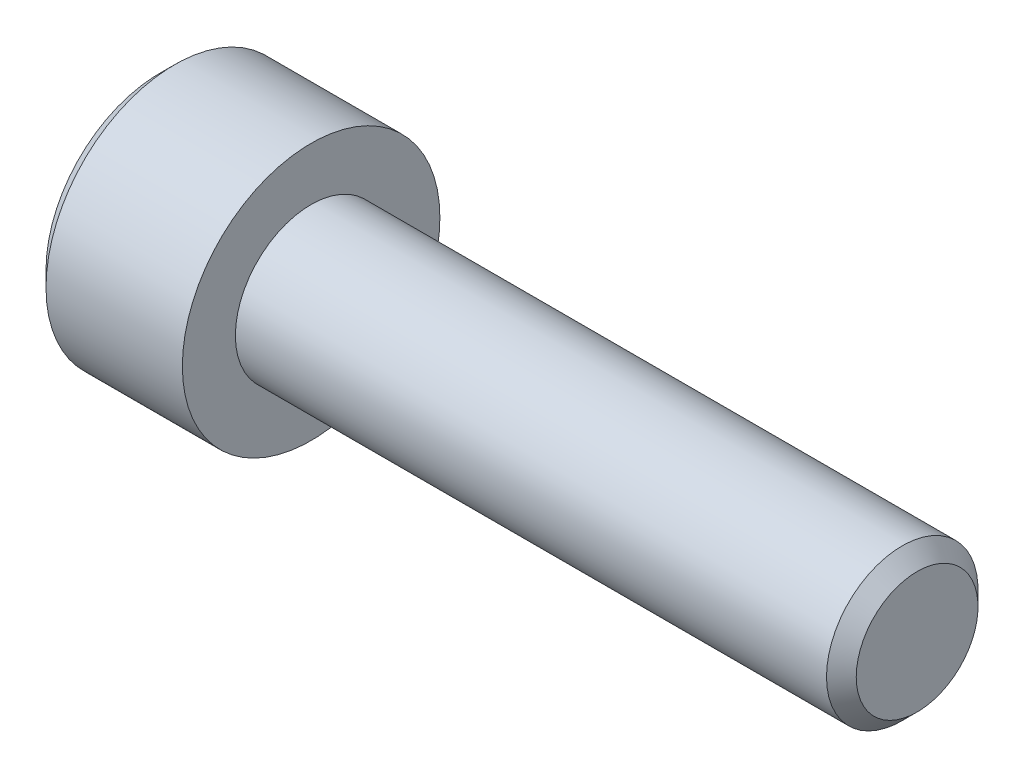
ISO-10303-21;
HEADER;
FILE_DESCRIPTION(('STEP AP214'),'2;1');
FILE_NAME('part.step','',(''),(''),'','','');
FILE_SCHEMA(('AUTOMOTIVE_DESIGN { 1 0 10303 214 1 1 1 1 }'));
ENDSEC;
DATA;
#1=APPLICATION_CONTEXT('core data for automotive mechanical design processes');
#2=APPLICATION_PROTOCOL_DEFINITION('international standard','automotive_design',2000,#1);
#3=PRODUCT_CONTEXT('',#1,'mechanical');
#4=PRODUCT('Part','Part','',(#3));
#5=PRODUCT_RELATED_PRODUCT_CATEGORY('part','',(#4));
#6=PRODUCT_DEFINITION_FORMATION('','',#4);
#7=PRODUCT_DEFINITION_CONTEXT('part definition',#1,'design');
#8=PRODUCT_DEFINITION('design','',#6,#7);
#9=PRODUCT_DEFINITION_SHAPE('','',#8);
#10=(LENGTH_UNIT() NAMED_UNIT(*) SI_UNIT(.MILLI.,.METRE.));
#11=(NAMED_UNIT(*) PLANE_ANGLE_UNIT() SI_UNIT($,.RADIAN.));
#12=(NAMED_UNIT(*) SI_UNIT($,.STERADIAN.) SOLID_ANGLE_UNIT());
#13=UNCERTAINTY_MEASURE_WITH_UNIT(LENGTH_MEASURE(1.E-05),#10,'distance_accuracy_value','');
#14=(GEOMETRIC_REPRESENTATION_CONTEXT(3) GLOBAL_UNCERTAINTY_ASSIGNED_CONTEXT((#13)) GLOBAL_UNIT_ASSIGNED_CONTEXT((#10,
#11,#12)) REPRESENTATION_CONTEXT('',''));
#15=CARTESIAN_POINT('',(0.,0.,0.));
#16=DIRECTION('',(0.,0.,1.));
#17=DIRECTION('',(1.,0.,0.));
#18=AXIS2_PLACEMENT_3D('',#15,#16,#17);
#19=CARTESIAN_POINT('',(-2.5,0.,0.));
#20=DIRECTION('',(1.,0.,0.));
#21=DIRECTION('',(0.,0.,-1.));
#22=AXIS2_PLACEMENT_3D('',#19,#20,#21);
#23=PLANE('',#22);
#24=DIRECTION('',(0.,1.,0.));
#25=VECTOR('',#24,1.);
#26=CARTESIAN_POINT('',(-2.5,0.,2.));
#27=LINE('',#26,#25);
#28=CARTESIAN_POINT('',(-2.5,1.15470053837925,2.));
#29=VERTEX_POINT('',#28);
#30=CARTESIAN_POINT('',(-2.49999999999988,0.,2.00000000000477));
#31=VERTEX_POINT('',#30);
#32=EDGE_CURVE('E109',#29,#31,#27,.F.);
#33=ORIENTED_EDGE('',*,*,#32,.F.);
#34=DIRECTION('',(0.,-0.500000000000003,0.866025403784437));
#35=VECTOR('',#34,1.);
#36=CARTESIAN_POINT('',(-2.5,1.73205080756888,1.));
#37=LINE('',#36,#35);
#38=CARTESIAN_POINT('',(-2.49999999999988,1.73205080757301,1.00000000000239));
#39=VERTEX_POINT('',#38);
#40=EDGE_CURVE('E93',#39,#29,#37,.T.);
#41=ORIENTED_EDGE('',*,*,#40,.F.);
#42=CARTESIAN_POINT('',(-2.49999999999977,0.,0.));
#43=DIRECTION('',(-1.,0.,0.));
#44=DIRECTION('',(0.,0.,1.));
#45=AXIS2_PLACEMENT_3D('',#42,#43,#44);
#46=CIRCLE('',#45,2.00000000000955);
#47=EDGE_CURVE('E20',#39,#31,#46,.F.);
#48=ORIENTED_EDGE('',*,*,#47,.T.);
#49=EDGE_LOOP('',(#33,#41,#48));
#50=FACE_BOUND('',#49,.T.);
#51=ADVANCED_FACE('F17',(#50),#23,.F.);
#52=CARTESIAN_POINT('',(-2.5,0.,0.));
#53=DIRECTION('',(1.,0.,0.));
#54=DIRECTION('',(0.,0.,-1.));
#55=AXIS2_PLACEMENT_3D('',#52,#53,#54);
#56=PLANE('',#55);
#57=DIRECTION('',(0.,0.499999999999996,-0.866025403784441));
#58=VECTOR('',#57,1.);
#59=CARTESIAN_POINT('',(-2.5,-2.3094010767585,0.));
#60=LINE('',#59,#58);
#61=CARTESIAN_POINT('',(-2.5,-2.3094010767585,0.));
#62=VERTEX_POINT('',#61);
#63=CARTESIAN_POINT('',(-2.49999999999988,-1.73205080757301,-1.00000000000239));
#64=VERTEX_POINT('',#63);
#65=EDGE_CURVE('E149',#62,#64,#60,.T.);
#66=ORIENTED_EDGE('',*,*,#65,.F.);
#67=DIRECTION('',(0.,-0.499999999999996,-0.866025403784441));
#68=VECTOR('',#67,1.);
#69=CARTESIAN_POINT('',(-2.5,-1.73205080756888,1.));
#70=LINE('',#69,#68);
#71=CARTESIAN_POINT('',(-2.49999999999977,-1.73205080757301,1.00000000000239));
#72=VERTEX_POINT('',#71);
#73=EDGE_CURVE('E153',#72,#62,#70,.T.);
#74=ORIENTED_EDGE('',*,*,#73,.F.);
#75=CARTESIAN_POINT('',(-2.49999999999977,0.,0.));
#76=DIRECTION('',(-1.,0.,0.));
#77=DIRECTION('',(0.,0.,1.));
#78=AXIS2_PLACEMENT_3D('',#75,#76,#77);
#79=CIRCLE('',#78,2.00000000000955);
#80=EDGE_CURVE('E123',#72,#64,#79,.F.);
#81=ORIENTED_EDGE('',*,*,#80,.T.);
#82=EDGE_LOOP('',(#66,#74,#81));
#83=FACE_BOUND('',#82,.T.);
#84=ADVANCED_FACE('F420',(#83),#56,.F.);
#85=CARTESIAN_POINT('',(-2.5,0.,0.));
#86=DIRECTION('',(1.,0.,0.));
#87=DIRECTION('',(0.,0.,-1.));
#88=AXIS2_PLACEMENT_3D('',#85,#86,#87);
#89=PLANE('',#88);
#90=DIRECTION('',(0.,1.,0.));
#91=VECTOR('',#90,1.);
#92=CARTESIAN_POINT('',(-2.5,0.,-2.));
#93=LINE('',#92,#91);
#94=CARTESIAN_POINT('',(-2.5,-1.15470053837925,-2.));
#95=VERTEX_POINT('',#94);
#96=CARTESIAN_POINT('',(-2.49999999999988,0.,-2.00000000000477));
#97=VERTEX_POINT('',#96);
#98=EDGE_CURVE('E141',#95,#97,#93,.T.);
#99=ORIENTED_EDGE('',*,*,#98,.F.);
#100=DIRECTION('',(0.,0.500000000000003,-0.866025403784437));
#101=VECTOR('',#100,1.);
#102=CARTESIAN_POINT('',(-2.5,-1.73205080756888,-1.));
#103=LINE('',#102,#101);
#104=EDGE_CURVE('E145',#64,#95,#103,.T.);
#105=ORIENTED_EDGE('',*,*,#104,.F.);
#106=CARTESIAN_POINT('',(-2.49999999999977,0.,0.));
#107=DIRECTION('',(-1.,0.,0.));
#108=DIRECTION('',(0.,0.,1.));
#109=AXIS2_PLACEMENT_3D('',#106,#107,#108);
#110=CIRCLE('',#109,2.00000000000955);
#111=EDGE_CURVE('E125',#64,#97,#110,.F.);
#112=ORIENTED_EDGE('',*,*,#111,.T.);
#113=EDGE_LOOP('',(#99,#105,#112));
#114=FACE_BOUND('',#113,.T.);
#115=ADVANCED_FACE('F207',(#114),#89,.F.);
#116=CARTESIAN_POINT('',(-2.5,0.,0.));
#117=DIRECTION('',(1.,0.,0.));
#118=DIRECTION('',(0.,0.,-1.));
#119=AXIS2_PLACEMENT_3D('',#116,#117,#118);
#120=PLANE('',#119);
#121=DIRECTION('',(0.,0.500000000000003,0.866025403784437));
#122=VECTOR('',#121,1.);
#123=CARTESIAN_POINT('',(-2.5,1.15470053837925,-2.));
#124=LINE('',#123,#122);
#125=CARTESIAN_POINT('',(-2.5,1.15470053837925,-2.));
#126=VERTEX_POINT('',#125);
#127=CARTESIAN_POINT('',(-2.49999999999988,1.73205080757301,-1.00000000000239));
#128=VERTEX_POINT('',#127);
#129=EDGE_CURVE('E101',#126,#128,#124,.T.);
#130=ORIENTED_EDGE('',*,*,#129,.F.);
#131=DIRECTION('',(0.,1.,0.));
#132=VECTOR('',#131,1.);
#133=CARTESIAN_POINT('',(-2.5,0.,-2.));
#134=LINE('',#133,#132);
#135=EDGE_CURVE('E137',#97,#126,#134,.T.);
#136=ORIENTED_EDGE('',*,*,#135,.F.);
#137=CARTESIAN_POINT('',(-2.49999999999977,0.,0.));
#138=DIRECTION('',(-1.,0.,0.));
#139=DIRECTION('',(0.,0.,1.));
#140=AXIS2_PLACEMENT_3D('',#137,#138,#139);
#141=CIRCLE('',#140,2.00000000000955);
#142=EDGE_CURVE('E117',#97,#128,#141,.F.);
#143=ORIENTED_EDGE('',*,*,#142,.T.);
#144=EDGE_LOOP('',(#130,#136,#143));
#145=FACE_BOUND('',#144,.T.);
#146=ADVANCED_FACE('F210',(#145),#120,.F.);
#147=CARTESIAN_POINT('',(-2.5,0.,0.));
#148=DIRECTION('',(1.,0.,0.));
#149=DIRECTION('',(0.,0.,-1.));
#150=AXIS2_PLACEMENT_3D('',#147,#148,#149);
#151=PLANE('',#150);
#152=CARTESIAN_POINT('',(-2.49999999999977,0.,0.));
#153=DIRECTION('',(-1.,0.,0.));
#154=DIRECTION('',(0.,0.,1.));
#155=AXIS2_PLACEMENT_3D('',#152,#153,#154);
#156=CIRCLE('',#155,2.00000000000955);
#157=EDGE_CURVE('E112',#128,#39,#156,.F.);
#158=ORIENTED_EDGE('',*,*,#157,.T.);
#159=DIRECTION('',(0.,-0.499999999999996,0.866025403784441));
#160=VECTOR('',#159,1.);
#161=CARTESIAN_POINT('',(-2.5,2.3094010767585,0.));
#162=LINE('',#161,#160);
#163=CARTESIAN_POINT('',(-2.5,2.3094010767585,0.));
#164=VERTEX_POINT('',#163);
#165=EDGE_CURVE('E89',#164,#39,#162,.T.);
#166=ORIENTED_EDGE('',*,*,#165,.F.);
#167=DIRECTION('',(0.,0.499999999999996,0.866025403784441));
#168=VECTOR('',#167,1.);
#169=CARTESIAN_POINT('',(-2.5,1.73205080756888,-1.));
#170=LINE('',#169,#168);
#171=EDGE_CURVE('E100',#128,#164,#170,.T.);
#172=ORIENTED_EDGE('',*,*,#171,.F.);
#173=EDGE_LOOP('',(#158,#166,#172));
#174=FACE_BOUND('',#173,.T.);
#175=ADVANCED_FACE('F113',(#174),#151,.F.);
#176=CARTESIAN_POINT('',(-2.4999999999693,0.,0.));
#177=DIRECTION('',(-1.,0.,0.));
#178=DIRECTION('',(0.,0.,1.));
#179=AXIS2_PLACEMENT_3D('',#176,#177,#178);
#180=CONICAL_SURFACE('',#179,1.99999999989586,1.30899693895162);
#181=CARTESIAN_POINT('',(-1.96410161512972,0.,-1.13686837721616E-10));
#182=VERTEX_POINT('',#181);
#183=VERTEX_LOOP('',#182);
#184=FACE_BOUND('',#183,.T.);
#185=ORIENTED_EDGE('',*,*,#142,.F.);
#186=ORIENTED_EDGE('',*,*,#111,.F.);
#187=ORIENTED_EDGE('',*,*,#80,.F.);
#188=CARTESIAN_POINT('',(-2.49999999999977,0.,0.));
#189=DIRECTION('',(-1.,0.,0.));
#190=DIRECTION('',(0.,0.,1.));
#191=AXIS2_PLACEMENT_3D('',#188,#189,#190);
#192=CIRCLE('',#191,2.00000000000955);
#193=EDGE_CURVE('E116',#72,#31,#192,.T.);
#194=ORIENTED_EDGE('',*,*,#193,.T.);
#195=ORIENTED_EDGE('',*,*,#47,.F.);
#196=ORIENTED_EDGE('',*,*,#157,.F.);
#197=EDGE_LOOP('',(#185,#186,#187,#194,#195,#196));
#198=FACE_BOUND('',#197,.T.);
#199=ADVANCED_FACE('F119',(#184,#198),#180,.F.);
#200=CARTESIAN_POINT('',(-2.5,0.,0.));
#201=DIRECTION('',(1.,0.,0.));
#202=DIRECTION('',(0.,0.,-1.));
#203=AXIS2_PLACEMENT_3D('',#200,#201,#202);
#204=PLANE('',#203);
#205=DIRECTION('',(0.,0.5,0.866025403784439));
#206=VECTOR('',#205,1.);
#207=CARTESIAN_POINT('',(-2.5,-1.15470053837925,2.));
#208=LINE('',#207,#206);
#209=CARTESIAN_POINT('',(-2.5,-1.15470053837925,2.));
#210=VERTEX_POINT('',#209);
#211=EDGE_CURVE('E197',#210,#72,#208,.F.);
#212=ORIENTED_EDGE('',*,*,#211,.F.);
#213=DIRECTION('',(0.,1.,0.));
#214=VECTOR('',#213,1.);
#215=CARTESIAN_POINT('',(-2.5,1.15470053837925,2.));
#216=LINE('',#215,#214);
#217=EDGE_CURVE('E227',#31,#210,#216,.F.);
#218=ORIENTED_EDGE('',*,*,#217,.F.);
#219=ORIENTED_EDGE('',*,*,#193,.F.);
#220=EDGE_LOOP('',(#212,#218,#219));
#221=FACE_BOUND('',#220,.T.);
#222=ADVANCED_FACE('F240',(#221),#204,.F.);
#223=CARTESIAN_POINT('',(-2.5,-1.15470053837925,2.));
#224=DIRECTION('',(0.,0.866025403784439,-0.5));
#225=DIRECTION('',(0.,0.5,0.866025403784439));
#226=AXIS2_PLACEMENT_3D('',#223,#224,#225);
#227=PLANE('',#226);
#228=ORIENTED_EDGE('',*,*,#73,.T.);
#229=DIRECTION('',(1.,0.,0.));
#230=VECTOR('',#229,1.);
#231=CARTESIAN_POINT('',(-2.5,-2.3094010767585,0.));
#232=LINE('',#231,#230);
#233=CARTESIAN_POINT('',(-5.,-2.3094010767585,0.));
#234=VERTEX_POINT('',#233);
#235=EDGE_CURVE('E170',#234,#62,#232,.T.);
#236=ORIENTED_EDGE('',*,*,#235,.F.);
#237=DIRECTION('',(0.,0.499999999999999,0.866025403784439));
#238=VECTOR('',#237,1.);
#239=CARTESIAN_POINT('',(-5.,-2.3094010767585,0.));
#240=LINE('',#239,#238);
#241=CARTESIAN_POINT('',(-5.,-1.15470053837925,2.));
#242=VERTEX_POINT('',#241);
#243=EDGE_CURVE('E175',#234,#242,#240,.T.);
#244=ORIENTED_EDGE('',*,*,#243,.T.);
#245=DIRECTION('',(-1.,0.,0.));
#246=VECTOR('',#245,1.);
#247=CARTESIAN_POINT('',(-2.5,-1.15470053837925,2.));
#248=LINE('',#247,#246);
#249=EDGE_CURVE('E183',#210,#242,#248,.T.);
#250=ORIENTED_EDGE('',*,*,#249,.F.);
#251=ORIENTED_EDGE('',*,*,#211,.T.);
#252=EDGE_LOOP('',(#228,#236,#244,#250,#251));
#253=FACE_BOUND('',#252,.T.);
#254=ADVANCED_FACE('F238',(#253),#227,.T.);
#255=CARTESIAN_POINT('',(-2.5,1.15470053837925,2.));
#256=DIRECTION('',(0.,0.,-1.));
#257=DIRECTION('',(-1.,0.,0.));
#258=AXIS2_PLACEMENT_3D('',#255,#256,#257);
#259=PLANE('',#258);
#260=ORIENTED_EDGE('',*,*,#217,.T.);
#261=ORIENTED_EDGE('',*,*,#249,.T.);
#262=DIRECTION('',(0.,1.,0.));
#263=VECTOR('',#262,1.);
#264=CARTESIAN_POINT('',(-5.,0.,2.));
#265=LINE('',#264,#263);
#266=CARTESIAN_POINT('',(-5.,1.15470053837925,2.));
#267=VERTEX_POINT('',#266);
#268=EDGE_CURVE('E221',#242,#267,#265,.T.);
#269=ORIENTED_EDGE('',*,*,#268,.T.);
#270=DIRECTION('',(1.,0.,0.));
#271=VECTOR('',#270,1.);
#272=CARTESIAN_POINT('',(-2.5,1.15470053837925,2.));
#273=LINE('',#272,#271);
#274=EDGE_CURVE('E166',#29,#267,#273,.F.);
#275=ORIENTED_EDGE('',*,*,#274,.F.);
#276=ORIENTED_EDGE('',*,*,#32,.T.);
#277=EDGE_LOOP('',(#260,#261,#269,#275,#276));
#278=FACE_BOUND('',#277,.T.);
#279=ADVANCED_FACE('F242',(#278),#259,.T.);
#280=CARTESIAN_POINT('',(-2.5,2.3094010767585,0.));
#281=DIRECTION('',(0.,-0.866025403784439,-0.5));
#282=DIRECTION('',(0.,0.5,-0.866025403784439));
#283=AXIS2_PLACEMENT_3D('',#280,#281,#282);
#284=PLANE('',#283);
#285=ORIENTED_EDGE('',*,*,#40,.T.);
#286=ORIENTED_EDGE('',*,*,#274,.T.);
#287=DIRECTION('',(0.,0.499999999999999,-0.866025403784439));
#288=VECTOR('',#287,1.);
#289=CARTESIAN_POINT('',(-5.,1.15470053837925,2.));
#290=LINE('',#289,#288);
#291=CARTESIAN_POINT('',(-5.,2.3094010767585,0.));
#292=VERTEX_POINT('',#291);
#293=EDGE_CURVE('E218',#267,#292,#290,.T.);
#294=ORIENTED_EDGE('',*,*,#293,.T.);
#295=DIRECTION('',(1.,0.,0.));
#296=VECTOR('',#295,1.);
#297=CARTESIAN_POINT('',(-2.5,2.3094010767585,0.));
#298=LINE('',#297,#296);
#299=EDGE_CURVE('E96',#164,#292,#298,.F.);
#300=ORIENTED_EDGE('',*,*,#299,.F.);
#301=ORIENTED_EDGE('',*,*,#165,.T.);
#302=EDGE_LOOP('',(#285,#286,#294,#300,#301));
#303=FACE_BOUND('',#302,.T.);
#304=ADVANCED_FACE('F91',(#303),#284,.T.);
#305=CARTESIAN_POINT('',(-2.5,1.15470053837925,-2.));
#306=DIRECTION('',(0.,-0.866025403784439,0.5));
#307=DIRECTION('',(0.,-0.5,-0.866025403784439));
#308=AXIS2_PLACEMENT_3D('',#305,#306,#307);
#309=PLANE('',#308);
#310=ORIENTED_EDGE('',*,*,#171,.T.);
#311=ORIENTED_EDGE('',*,*,#299,.T.);
#312=DIRECTION('',(0.,-0.499999999999999,-0.866025403784439));
#313=VECTOR('',#312,1.);
#314=CARTESIAN_POINT('',(-5.,2.3094010767585,0.));
#315=LINE('',#314,#313);
#316=CARTESIAN_POINT('',(-5.,1.15470053837925,-2.));
#317=VERTEX_POINT('',#316);
#318=EDGE_CURVE('E215',#292,#317,#315,.T.);
#319=ORIENTED_EDGE('',*,*,#318,.T.);
#320=DIRECTION('',(1.,0.,0.));
#321=VECTOR('',#320,1.);
#322=CARTESIAN_POINT('',(-2.5,1.15470053837925,-2.));
#323=LINE('',#322,#321);
#324=EDGE_CURVE('E165',#126,#317,#323,.F.);
#325=ORIENTED_EDGE('',*,*,#324,.F.);
#326=ORIENTED_EDGE('',*,*,#129,.T.);
#327=EDGE_LOOP('',(#310,#311,#319,#325,#326));
#328=FACE_BOUND('',#327,.T.);
#329=ADVANCED_FACE('F213',(#328),#309,.T.);
#330=CARTESIAN_POINT('',(-2.5,-1.15470053837925,-2.));
#331=DIRECTION('',(0.,0.,1.));
#332=DIRECTION('',(1.,0.,0.));
#333=AXIS2_PLACEMENT_3D('',#330,#331,#332);
#334=PLANE('',#333);
#335=ORIENTED_EDGE('',*,*,#135,.T.);
#336=ORIENTED_EDGE('',*,*,#324,.T.);
#337=DIRECTION('',(0.,1.,0.));
#338=VECTOR('',#337,1.);
#339=CARTESIAN_POINT('',(-5.,0.,-2.));
#340=LINE('',#339,#338);
#341=CARTESIAN_POINT('',(-5.,-1.15470053837925,-2.));
#342=VERTEX_POINT('',#341);
#343=EDGE_CURVE('E35',#317,#342,#340,.F.);
#344=ORIENTED_EDGE('',*,*,#343,.T.);
#345=DIRECTION('',(1.,0.,0.));
#346=VECTOR('',#345,1.);
#347=CARTESIAN_POINT('',(-2.5,-1.15470053837925,-2.));
#348=LINE('',#347,#346);
#349=EDGE_CURVE('E173',#95,#342,#348,.F.);
#350=ORIENTED_EDGE('',*,*,#349,.F.);
#351=ORIENTED_EDGE('',*,*,#98,.T.);
#352=EDGE_LOOP('',(#335,#336,#344,#350,#351));
#353=FACE_BOUND('',#352,.T.);
#354=ADVANCED_FACE('F212',(#353),#334,.T.);
#355=CARTESIAN_POINT('',(-2.5,-2.3094010767585,0.));
#356=DIRECTION('',(0.,0.866025403784439,0.5));
#357=DIRECTION('',(0.,-0.5,0.866025403784439));
#358=AXIS2_PLACEMENT_3D('',#355,#356,#357);
#359=PLANE('',#358);
#360=ORIENTED_EDGE('',*,*,#104,.T.);
#361=ORIENTED_EDGE('',*,*,#349,.T.);
#362=DIRECTION('',(0.,-0.499999999999999,0.866025403784439));
#363=VECTOR('',#362,1.);
#364=CARTESIAN_POINT('',(-5.,-1.15470053837925,-2.));
#365=LINE('',#364,#363);
#366=EDGE_CURVE('E196',#342,#234,#365,.T.);
#367=ORIENTED_EDGE('',*,*,#366,.T.);
#368=ORIENTED_EDGE('',*,*,#235,.T.);
#369=ORIENTED_EDGE('',*,*,#65,.T.);
#370=EDGE_LOOP('',(#360,#361,#367,#368,#369));
#371=FACE_BOUND('',#370,.T.);
#372=ADVANCED_FACE('F251',(#371),#359,.T.);
#373=CARTESIAN_POINT('',(-5.,0.,0.));
#374=DIRECTION('',(1.,0.,0.));
#375=DIRECTION('',(0.,0.,-1.));
#376=AXIS2_PLACEMENT_3D('',#373,#374,#375);
#377=PLANE('',#376);
#378=ORIENTED_EDGE('',*,*,#343,.F.);
#379=ORIENTED_EDGE('',*,*,#318,.F.);
#380=ORIENTED_EDGE('',*,*,#293,.F.);
#381=ORIENTED_EDGE('',*,*,#268,.F.);
#382=ORIENTED_EDGE('',*,*,#243,.F.);
#383=ORIENTED_EDGE('',*,*,#366,.F.);
#384=EDGE_LOOP('',(#378,#379,#380,#381,#382,#383));
#385=FACE_BOUND('',#384,.T.);
#386=CARTESIAN_POINT('',(-4.99999999999545,0.,0.));
#387=DIRECTION('',(1.,0.,0.));
#388=DIRECTION('',(0.,0.,-1.));
#389=AXIS2_PLACEMENT_3D('',#386,#387,#388);
#390=CIRCLE('',#389,3.74999999996817);
#391=CARTESIAN_POINT('',(-4.99999999999545,0.,-3.74999999996817));
#392=VERTEX_POINT('',#391);
#393=EDGE_CURVE('E193',#392,#392,#390,.T.);
#394=ORIENTED_EDGE('',*,*,#393,.F.);
#395=EDGE_LOOP('',(#394));
#396=FACE_BOUND('',#395,.T.);
#397=ADVANCED_FACE('F244',(#385,#396),#377,.F.);
#398=CARTESIAN_POINT('',(-4.50000000000728,0.,0.));
#399=DIRECTION('',(1.,0.,0.));
#400=DIRECTION('',(0.,0.,-1.));
#401=AXIS2_PLACEMENT_3D('',#398,#399,#400);
#402=CONICAL_SURFACE('',#401,4.25000000001319,0.785398163454292);
#403=ORIENTED_EDGE('',*,*,#393,.T.);
#404=EDGE_LOOP('',(#403));
#405=FACE_BOUND('',#404,.T.);
#406=CARTESIAN_POINT('',(-4.5,0.,0.));
#407=DIRECTION('',(-1.,0.,0.));
#408=DIRECTION('',(0.,0.,1.));
#409=AXIS2_PLACEMENT_3D('',#406,#407,#408);
#410=CIRCLE('',#409,4.25);
#411=CARTESIAN_POINT('',(-4.5,0.,4.25));
#412=VERTEX_POINT('',#411);
#413=EDGE_CURVE('E192',#412,#412,#410,.F.);
#414=ORIENTED_EDGE('',*,*,#413,.F.);
#415=EDGE_LOOP('',(#414));
#416=FACE_BOUND('',#415,.T.);
#417=ADVANCED_FACE('F274',(#405,#416),#402,.T.);
#418=CARTESIAN_POINT('',(20.,2.0095,0.));
#419=DIRECTION('',(-1.,0.,0.));
#420=DIRECTION('',(0.,0.,1.));
#421=AXIS2_PLACEMENT_3D('',#418,#419,#420);
#422=PLANE('',#421);
#423=CARTESIAN_POINT('',(20.0000000000387,0.,0.));
#424=DIRECTION('',(-1.,0.,0.));
#425=DIRECTION('',(0.,0.,1.));
#426=AXIS2_PLACEMENT_3D('',#423,#424,#425);
#427=CIRCLE('',#426,2.00949999998556);
#428=CARTESIAN_POINT('',(20.0000000000387,0.,2.00949999998556));
#429=VERTEX_POINT('',#428);
#430=EDGE_CURVE('E189',#429,#429,#427,.T.);
#431=ORIENTED_EDGE('',*,*,#430,.F.);
#432=EDGE_LOOP('',(#431));
#433=FACE_BOUND('',#432,.T.);
#434=ADVANCED_FACE('F272',(#433),#422,.F.);
#435=CARTESIAN_POINT('',(20.,0.,0.));
#436=DIRECTION('',(-1.,0.,0.));
#437=DIRECTION('',(0.,0.,1.));
#438=AXIS2_PLACEMENT_3D('',#435,#436,#437);
#439=CYLINDRICAL_SURFACE('',#438,4.25);
#440=ORIENTED_EDGE('',*,*,#413,.T.);
#441=EDGE_LOOP('',(#440));
#442=FACE_BOUND('',#441,.T.);
#443=CARTESIAN_POINT('',(0.,0.,0.));
#444=DIRECTION('',(-1.,0.,0.));
#445=DIRECTION('',(0.,0.,1.));
#446=AXIS2_PLACEMENT_3D('',#443,#444,#445);
#447=CIRCLE('',#446,4.25);
#448=CARTESIAN_POINT('',(0.,0.,4.25));
#449=VERTEX_POINT('',#448);
#450=EDGE_CURVE('E186',#449,#449,#447,.T.);
#451=ORIENTED_EDGE('',*,*,#450,.T.);
#452=EDGE_LOOP('',(#451));
#453=FACE_BOUND('',#452,.T.);
#454=ADVANCED_FACE('F268',(#442,#453),#439,.T.);
#455=CARTESIAN_POINT('',(19.5094999999696,0.,0.));
#456=DIRECTION('',(-1.,0.,0.));
#457=DIRECTION('',(0.,0.,1.));
#458=AXIS2_PLACEMENT_3D('',#455,#456,#457);
#459=CONICAL_SURFACE('',#458,2.50000000005457,0.785398163397448);
#460=CARTESIAN_POINT('',(19.5095,0.,0.));
#461=DIRECTION('',(-1.,0.,0.));
#462=DIRECTION('',(0.,0.,1.));
#463=AXIS2_PLACEMENT_3D('',#460,#461,#462);
#464=CIRCLE('',#463,2.5);
#465=CARTESIAN_POINT('',(19.5095,0.,2.5));
#466=VERTEX_POINT('',#465);
#467=EDGE_CURVE('E26',#466,#466,#464,.T.);
#468=ORIENTED_EDGE('',*,*,#467,.F.);
#469=EDGE_LOOP('',(#468));
#470=FACE_BOUND('',#469,.T.);
#471=ORIENTED_EDGE('',*,*,#430,.T.);
#472=EDGE_LOOP('',(#471));
#473=FACE_BOUND('',#472,.T.);
#474=ADVANCED_FACE('F264',(#470,#473),#459,.T.);
#475=CARTESIAN_POINT('',(0.,4.25,0.));
#476=DIRECTION('',(-1.,0.,0.));
#477=DIRECTION('',(0.,0.,1.));
#478=AXIS2_PLACEMENT_3D('',#475,#476,#477);
#479=PLANE('',#478);
#480=ORIENTED_EDGE('',*,*,#450,.F.);
#481=EDGE_LOOP('',(#480));
#482=FACE_BOUND('',#481,.T.);
#483=CARTESIAN_POINT('',(0.,0.,0.));
#484=DIRECTION('',(-1.,0.,0.));
#485=DIRECTION('',(0.,0.,1.));
#486=AXIS2_PLACEMENT_3D('',#483,#484,#485);
#487=CIRCLE('',#486,2.5);
#488=CARTESIAN_POINT('',(0.,0.,2.5));
#489=VERTEX_POINT('',#488);
#490=EDGE_CURVE('E11',#489,#489,#487,.F.);
#491=ORIENTED_EDGE('',*,*,#490,.F.);
#492=EDGE_LOOP('',(#491));
#493=FACE_BOUND('',#492,.T.);
#494=ADVANCED_FACE('F267',(#482,#493),#479,.F.);
#495=CARTESIAN_POINT('',(20.,0.,0.));
#496=DIRECTION('',(-1.,0.,0.));
#497=DIRECTION('',(0.,0.,1.));
#498=AXIS2_PLACEMENT_3D('',#495,#496,#497);
#499=CYLINDRICAL_SURFACE('',#498,2.5);
#500=ORIENTED_EDGE('',*,*,#490,.T.);
#501=EDGE_LOOP('',(#500));
#502=FACE_BOUND('',#501,.T.);
#503=ORIENTED_EDGE('',*,*,#467,.T.);
#504=EDGE_LOOP('',(#503));
#505=FACE_BOUND('',#504,.T.);
#506=ADVANCED_FACE('F262',(#502,#505),#499,.T.);
#507=CLOSED_SHELL('',(#51,#84,#115,#146,#175,#199,#222,#254,#279,#304,#329,#354,#372,#397,#417,
#434,#454,#474,#494,#506));
#508=MANIFOLD_SOLID_BREP('B1',#507);
#509=ADVANCED_BREP_SHAPE_REPRESENTATION('',(#18,#508),#14);
#510=SHAPE_DEFINITION_REPRESENTATION(#9,#509);
ENDSEC;
END-ISO-10303-21;
